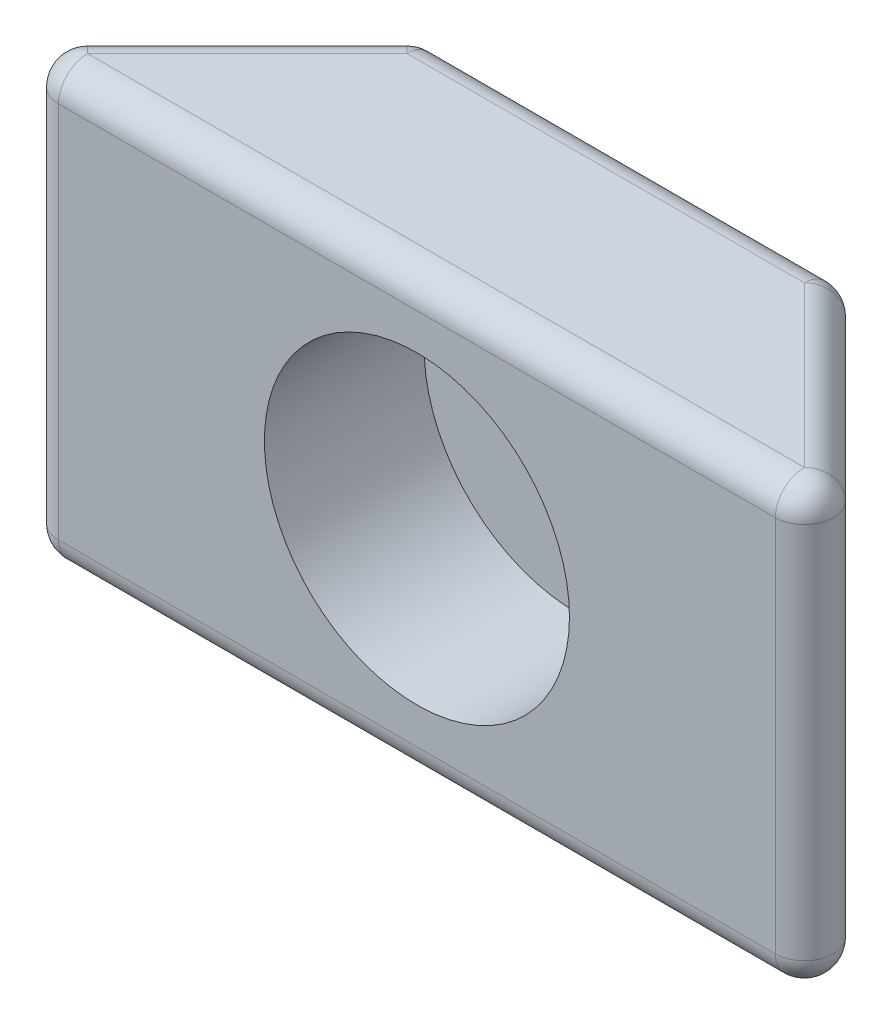
ISO-10303-21;
HEADER;
FILE_DESCRIPTION(('STEP AP214'),'2;1');
FILE_NAME('part.step','',(''),(''),'','','');
FILE_SCHEMA(('AUTOMOTIVE_DESIGN { 1 0 10303 214 1 1 1 1 }'));
ENDSEC;
DATA;
#1=APPLICATION_CONTEXT('core data for automotive mechanical design processes');
#2=APPLICATION_PROTOCOL_DEFINITION('international standard','automotive_design',2000,#1);
#3=PRODUCT_CONTEXT('',#1,'mechanical');
#4=PRODUCT('Part','Part','',(#3));
#5=PRODUCT_RELATED_PRODUCT_CATEGORY('part','',(#4));
#6=PRODUCT_DEFINITION_FORMATION('','',#4);
#7=PRODUCT_DEFINITION_CONTEXT('part definition',#1,'design');
#8=PRODUCT_DEFINITION('design','',#6,#7);
#9=PRODUCT_DEFINITION_SHAPE('','',#8);
#10=(LENGTH_UNIT() NAMED_UNIT(*) SI_UNIT(.MILLI.,.METRE.));
#11=(NAMED_UNIT(*) PLANE_ANGLE_UNIT() SI_UNIT($,.RADIAN.));
#12=(NAMED_UNIT(*) SI_UNIT($,.STERADIAN.) SOLID_ANGLE_UNIT());
#13=UNCERTAINTY_MEASURE_WITH_UNIT(LENGTH_MEASURE(1.E-05),#10,'distance_accuracy_value','');
#14=(GEOMETRIC_REPRESENTATION_CONTEXT(3) GLOBAL_UNCERTAINTY_ASSIGNED_CONTEXT((#13)) GLOBAL_UNIT_ASSIGNED_CONTEXT((#10,
#11,#12)) REPRESENTATION_CONTEXT('',''));
#15=CARTESIAN_POINT('',(0.,0.,0.));
#16=DIRECTION('',(0.,0.,1.));
#17=DIRECTION('',(1.,0.,0.));
#18=AXIS2_PLACEMENT_3D('',#15,#16,#17);
#19=CARTESIAN_POINT('',(-2.9,3.,-3.));
#20=DIRECTION('',(0.707106781186544,0.,0.707106781186551));
#21=DIRECTION('',(0.707106781186551,0.,-0.707106781186544));
#22=AXIS2_PLACEMENT_3D('',#19,#20,#21);
#23=PLANE('',#22);
#24=DIRECTION('',(-0.707106781186551,0.,0.707106781186544));
#25=VECTOR('',#24,1.);
#26=CARTESIAN_POINT('',(-2.9,2.6,-3.));
#27=LINE('',#26,#25);
#28=CARTESIAN_POINT('',(-5.2171572875254,2.6,-0.682842712474621));
#29=VERTEX_POINT('',#28);
#30=CARTESIAN_POINT('',(-3.01715728752538,2.6,-2.88284271247462));
#31=VERTEX_POINT('',#30);
#32=EDGE_CURVE('E47',#29,#31,#27,.F.);
#33=ORIENTED_EDGE('',*,*,#32,.T.);
#34=DIRECTION('',(0.,-1.,0.));
#35=VECTOR('',#34,1.);
#36=CARTESIAN_POINT('',(-3.01715728752538,3.,-2.88284271247462));
#37=LINE('',#36,#35);
#38=CARTESIAN_POINT('',(-3.01715728752538,-2.6,-2.88284271247462));
#39=VERTEX_POINT('',#38);
#40=EDGE_CURVE('E11',#31,#39,#37,.T.);
#41=ORIENTED_EDGE('',*,*,#40,.T.);
#42=DIRECTION('',(-0.707106781186551,0.,0.707106781186544));
#43=VECTOR('',#42,1.);
#44=CARTESIAN_POINT('',(-5.90000000000003,-2.6,0.));
#45=LINE('',#44,#43);
#46=CARTESIAN_POINT('',(-5.2171572875254,-2.6,-0.682842712474621));
#47=VERTEX_POINT('',#46);
#48=EDGE_CURVE('E200',#39,#47,#45,.T.);
#49=ORIENTED_EDGE('',*,*,#48,.T.);
#50=DIRECTION('',(0.,-1.,0.));
#51=VECTOR('',#50,1.);
#52=CARTESIAN_POINT('',(-5.2171572875254,3.,-0.682842712474622));
#53=LINE('',#52,#51);
#54=EDGE_CURVE('E58',#47,#29,#53,.F.);
#55=ORIENTED_EDGE('',*,*,#54,.T.);
#56=EDGE_LOOP('',(#33,#41,#49,#55));
#57=FACE_BOUND('',#56,.T.);
#58=ADVANCED_FACE('F38',(#57),#23,.F.);
#59=CARTESIAN_POINT('',(-5.90000000000003,3.,0.));
#60=DIRECTION('',(0.,0.,-1.));
#61=DIRECTION('',(-1.,0.,0.));
#62=AXIS2_PLACEMENT_3D('',#59,#60,#61);
#63=PLANE('',#62);
#64=DIRECTION('',(1.,0.,0.));
#65=VECTOR('',#64,1.);
#66=CARTESIAN_POINT('',(5.90000000000003,-2.6,0.));
#67=LINE('',#66,#65);
#68=CARTESIAN_POINT('',(-4.93431457505079,-2.6,0.));
#69=VERTEX_POINT('',#68);
#70=CARTESIAN_POINT('',(4.93431457505079,-2.6,0.));
#71=VERTEX_POINT('',#70);
#72=EDGE_CURVE('E175',#69,#71,#67,.T.);
#73=ORIENTED_EDGE('',*,*,#72,.T.);
#74=DIRECTION('',(0.,-1.,0.));
#75=VECTOR('',#74,1.);
#76=CARTESIAN_POINT('',(4.93431457505079,3.,0.));
#77=LINE('',#76,#75);
#78=CARTESIAN_POINT('',(4.93431457505079,2.6,0.));
#79=VERTEX_POINT('',#78);
#80=EDGE_CURVE('E180',#71,#79,#77,.F.);
#81=ORIENTED_EDGE('',*,*,#80,.T.);
#82=DIRECTION('',(1.,0.,0.));
#83=VECTOR('',#82,1.);
#84=CARTESIAN_POINT('',(-5.90000000000003,2.6,0.));
#85=LINE('',#84,#83);
#86=CARTESIAN_POINT('',(-4.93431457505079,2.6,0.));
#87=VERTEX_POINT('',#86);
#88=EDGE_CURVE('E177',#79,#87,#85,.F.);
#89=ORIENTED_EDGE('',*,*,#88,.T.);
#90=DIRECTION('',(0.,-1.,0.));
#91=VECTOR('',#90,1.);
#92=CARTESIAN_POINT('',(-4.93431457505079,3.,0.));
#93=LINE('',#92,#91);
#94=EDGE_CURVE('E173',#87,#69,#93,.T.);
#95=ORIENTED_EDGE('',*,*,#94,.T.);
#96=EDGE_LOOP('',(#73,#81,#89,#95));
#97=FACE_BOUND('',#96,.T.);
#98=CARTESIAN_POINT('',(0.,0.,0.));
#99=DIRECTION('',(0.,0.,1.));
#100=DIRECTION('',(1.,0.,0.));
#101=AXIS2_PLACEMENT_3D('',#98,#99,#100);
#102=CIRCLE('',#101,2.1);
#103=CARTESIAN_POINT('',(2.1,0.,0.));
#104=VERTEX_POINT('',#103);
#105=EDGE_CURVE('E261',#104,#104,#102,.T.);
#106=ORIENTED_EDGE('',*,*,#105,.F.);
#107=EDGE_LOOP('',(#106));
#108=FACE_BOUND('',#107,.T.);
#109=ADVANCED_FACE('F289',(#97,#108),#63,.F.);
#110=CARTESIAN_POINT('',(5.90000000000003,3.,0.));
#111=DIRECTION('',(-0.707106781186544,0.,0.707106781186551));
#112=DIRECTION('',(0.707106781186551,0.,0.707106781186544));
#113=AXIS2_PLACEMENT_3D('',#110,#111,#112);
#114=PLANE('',#113);
#115=DIRECTION('',(-0.707106781186551,0.,-0.707106781186544));
#116=VECTOR('',#115,1.);
#117=CARTESIAN_POINT('',(5.90000000000003,2.6,0.));
#118=LINE('',#117,#116);
#119=CARTESIAN_POINT('',(3.01715728752538,2.6,-2.88284271247462));
#120=VERTEX_POINT('',#119);
#121=CARTESIAN_POINT('',(5.2171572875254,2.6,-0.682842712474621));
#122=VERTEX_POINT('',#121);
#123=EDGE_CURVE('E195',#120,#122,#118,.F.);
#124=ORIENTED_EDGE('',*,*,#123,.T.);
#125=DIRECTION('',(0.,-1.,0.));
#126=VECTOR('',#125,1.);
#127=CARTESIAN_POINT('',(5.2171572875254,3.,-0.682842712474621));
#128=LINE('',#127,#126);
#129=CARTESIAN_POINT('',(5.2171572875254,-2.6,-0.682842712474621));
#130=VERTEX_POINT('',#129);
#131=EDGE_CURVE('E197',#122,#130,#128,.T.);
#132=ORIENTED_EDGE('',*,*,#131,.T.);
#133=DIRECTION('',(-0.707106781186551,0.,-0.707106781186544));
#134=VECTOR('',#133,1.);
#135=CARTESIAN_POINT('',(2.9,-2.6,-3.));
#136=LINE('',#135,#134);
#137=CARTESIAN_POINT('',(3.01715728752538,-2.6,-2.88284271247462));
#138=VERTEX_POINT('',#137);
#139=EDGE_CURVE('E191',#130,#138,#136,.T.);
#140=ORIENTED_EDGE('',*,*,#139,.T.);
#141=DIRECTION('',(0.,-1.,0.));
#142=VECTOR('',#141,1.);
#143=CARTESIAN_POINT('',(3.01715728752538,3.,-2.88284271247462));
#144=LINE('',#143,#142);
#145=EDGE_CURVE('E193',#138,#120,#144,.F.);
#146=ORIENTED_EDGE('',*,*,#145,.T.);
#147=EDGE_LOOP('',(#124,#132,#140,#146));
#148=FACE_BOUND('',#147,.T.);
#149=ADVANCED_FACE('F294',(#148),#114,.F.);
#150=CARTESIAN_POINT('',(2.9,3.,-3.));
#151=DIRECTION('',(0.,0.,1.));
#152=DIRECTION('',(1.,0.,0.));
#153=AXIS2_PLACEMENT_3D('',#150,#151,#152);
#154=PLANE('',#153);
#155=DIRECTION('',(-1.,0.,0.));
#156=VECTOR('',#155,1.);
#157=CARTESIAN_POINT('',(2.9,2.6,-3.));
#158=LINE('',#157,#156);
#159=CARTESIAN_POINT('',(-2.73431457505076,2.6,-3.));
#160=VERTEX_POINT('',#159);
#161=CARTESIAN_POINT('',(2.73431457505076,2.6,-3.));
#162=VERTEX_POINT('',#161);
#163=EDGE_CURVE('E134',#160,#162,#158,.F.);
#164=ORIENTED_EDGE('',*,*,#163,.T.);
#165=DIRECTION('',(0.,-1.,0.));
#166=VECTOR('',#165,1.);
#167=CARTESIAN_POINT('',(2.73431457505076,3.,-3.));
#168=LINE('',#167,#166);
#169=CARTESIAN_POINT('',(2.73431457505076,-2.6,-3.));
#170=VERTEX_POINT('',#169);
#171=EDGE_CURVE('E171',#162,#170,#168,.T.);
#172=ORIENTED_EDGE('',*,*,#171,.T.);
#173=DIRECTION('',(-1.,0.,0.));
#174=VECTOR('',#173,1.);
#175=CARTESIAN_POINT('',(-2.9,-2.6,-3.));
#176=LINE('',#175,#174);
#177=CARTESIAN_POINT('',(-2.73431457505076,-2.6,-3.));
#178=VERTEX_POINT('',#177);
#179=EDGE_CURVE('E168',#170,#178,#176,.T.);
#180=ORIENTED_EDGE('',*,*,#179,.T.);
#181=DIRECTION('',(0.,-1.,0.));
#182=VECTOR('',#181,1.);
#183=CARTESIAN_POINT('',(-2.73431457505076,3.,-3.));
#184=LINE('',#183,#182);
#185=EDGE_CURVE('E163',#178,#160,#184,.F.);
#186=ORIENTED_EDGE('',*,*,#185,.T.);
#187=EDGE_LOOP('',(#164,#172,#180,#186));
#188=FACE_BOUND('',#187,.T.);
#189=ADVANCED_FACE('F395',(#188),#154,.F.);
#190=CARTESIAN_POINT('',(0.,3.,0.));
#191=DIRECTION('',(0.,-1.,0.));
#192=DIRECTION('',(0.,0.,-1.));
#193=AXIS2_PLACEMENT_3D('',#190,#191,#192);
#194=PLANE('',#193);
#195=DIRECTION('',(1.,0.,0.));
#196=VECTOR('',#195,1.);
#197=CARTESIAN_POINT('',(0.,3.,-0.400000000000001));
#198=LINE('',#197,#196);
#199=CARTESIAN_POINT('',(-4.93431457505079,3.,-0.400000000000001));
#200=VERTEX_POINT('',#199);
#201=CARTESIAN_POINT('',(4.93431457505078,3.,-0.400000000000001));
#202=VERTEX_POINT('',#201);
#203=EDGE_CURVE('E155',#200,#202,#198,.T.);
#204=ORIENTED_EDGE('',*,*,#203,.T.);
#205=DIRECTION('',(-0.707106781186551,0.,-0.707106781186544));
#206=VECTOR('',#205,1.);
#207=CARTESIAN_POINT('',(2.66715728752537,3.,-2.66715728752539));
#208=LINE('',#207,#206);
#209=CARTESIAN_POINT('',(2.73431457505076,3.,-2.6));
#210=VERTEX_POINT('',#209);
#211=EDGE_CURVE('E160',#202,#210,#208,.T.);
#212=ORIENTED_EDGE('',*,*,#211,.T.);
#213=DIRECTION('',(-1.,0.,0.));
#214=VECTOR('',#213,1.);
#215=CARTESIAN_POINT('',(0.,3.,-2.6));
#216=LINE('',#215,#214);
#217=CARTESIAN_POINT('',(-2.73431457505076,3.,-2.6));
#218=VERTEX_POINT('',#217);
#219=EDGE_CURVE('E132',#210,#218,#216,.T.);
#220=ORIENTED_EDGE('',*,*,#219,.T.);
#221=DIRECTION('',(-0.707106781186551,0.,0.707106781186544));
#222=VECTOR('',#221,1.);
#223=CARTESIAN_POINT('',(-2.66715728752537,3.,-2.6671572875254));
#224=LINE('',#223,#222);
#225=EDGE_CURVE('E149',#218,#200,#224,.T.);
#226=ORIENTED_EDGE('',*,*,#225,.T.);
#227=EDGE_LOOP('',(#204,#212,#220,#226));
#228=FACE_BOUND('',#227,.T.);
#229=ADVANCED_FACE('F158',(#228),#194,.F.);
#230=CARTESIAN_POINT('',(0.,-3.,0.));
#231=DIRECTION('',(0.,-1.,0.));
#232=DIRECTION('',(0.,0.,-1.));
#233=AXIS2_PLACEMENT_3D('',#230,#231,#232);
#234=PLANE('',#233);
#235=DIRECTION('',(-1.,0.,0.));
#236=VECTOR('',#235,1.);
#237=CARTESIAN_POINT('',(2.9,-3.,-2.6));
#238=LINE('',#237,#236);
#239=CARTESIAN_POINT('',(-2.73431457505076,-3.,-2.6));
#240=VERTEX_POINT('',#239);
#241=CARTESIAN_POINT('',(2.73431457505076,-3.,-2.6));
#242=VERTEX_POINT('',#241);
#243=EDGE_CURVE('E184',#240,#242,#238,.F.);
#244=ORIENTED_EDGE('',*,*,#243,.T.);
#245=DIRECTION('',(-0.707106781186551,0.,-0.707106781186544));
#246=VECTOR('',#245,1.);
#247=CARTESIAN_POINT('',(5.61715728752541,-3.,0.282842712474619));
#248=LINE('',#247,#246);
#249=CARTESIAN_POINT('',(4.93431457505079,-3.,-0.400000000000001));
#250=VERTEX_POINT('',#249);
#251=EDGE_CURVE('E189',#242,#250,#248,.F.);
#252=ORIENTED_EDGE('',*,*,#251,.T.);
#253=DIRECTION('',(1.,0.,0.));
#254=VECTOR('',#253,1.);
#255=CARTESIAN_POINT('',(-5.90000000000003,-3.,-0.400000000000001));
#256=LINE('',#255,#254);
#257=CARTESIAN_POINT('',(-4.93431457505079,-3.,-0.400000000000001));
#258=VERTEX_POINT('',#257);
#259=EDGE_CURVE('E186',#250,#258,#256,.F.);
#260=ORIENTED_EDGE('',*,*,#259,.T.);
#261=DIRECTION('',(-0.707106781186551,0.,0.707106781186544));
#262=VECTOR('',#261,1.);
#263=CARTESIAN_POINT('',(-2.61715728752538,-3.,-2.71715728752538));
#264=LINE('',#263,#262);
#265=EDGE_CURVE('E182',#258,#240,#264,.F.);
#266=ORIENTED_EDGE('',*,*,#265,.T.);
#267=EDGE_LOOP('',(#244,#252,#260,#266));
#268=FACE_BOUND('',#267,.T.);
#269=ADVANCED_FACE('F278',(#268),#234,.T.);
#270=CARTESIAN_POINT('',(0.,0.,-2.2));
#271=DIRECTION('',(0.,0.,1.));
#272=DIRECTION('',(1.,0.,0.));
#273=AXIS2_PLACEMENT_3D('',#270,#271,#272);
#274=CYLINDRICAL_SURFACE('',#273,2.1);
#275=CARTESIAN_POINT('',(0.,0.,-2.2));
#276=DIRECTION('',(0.,0.,1.));
#277=DIRECTION('',(1.,0.,0.));
#278=AXIS2_PLACEMENT_3D('',#275,#276,#277);
#279=CIRCLE('',#278,2.1);
#280=CARTESIAN_POINT('',(2.1,0.,-2.2));
#281=VERTEX_POINT('',#280);
#282=EDGE_CURVE('E156',#281,#281,#279,.T.);
#283=ORIENTED_EDGE('',*,*,#282,.F.);
#284=EDGE_LOOP('',(#283));
#285=FACE_BOUND('',#284,.T.);
#286=ORIENTED_EDGE('',*,*,#105,.T.);
#287=EDGE_LOOP('',(#286));
#288=FACE_BOUND('',#287,.T.);
#289=ADVANCED_FACE('F276',(#285,#288),#274,.F.);
#290=CARTESIAN_POINT('',(0.,0.,-2.2));
#291=DIRECTION('',(0.,0.,1.));
#292=DIRECTION('',(1.,0.,0.));
#293=AXIS2_PLACEMENT_3D('',#290,#291,#292);
#294=PLANE('',#293);
#295=ORIENTED_EDGE('',*,*,#282,.T.);
#296=EDGE_LOOP('',(#295));
#297=FACE_BOUND('',#296,.T.);
#298=ADVANCED_FACE('F274',(#297),#294,.T.);
#299=CARTESIAN_POINT('',(-5.90000000000003,-2.6,-0.400000000000001));
#300=DIRECTION('',(-1.,0.,0.));
#301=DIRECTION('',(0.,0.,1.));
#302=AXIS2_PLACEMENT_3D('',#299,#300,#301);
#303=CYLINDRICAL_SURFACE('',#302,0.4);
#304=CARTESIAN_POINT('',(4.93431457505079,-2.6,-0.400000000000001));
#305=DIRECTION('',(1.,0.,0.));
#306=DIRECTION('',(0.,0.,-1.));
#307=AXIS2_PLACEMENT_3D('',#304,#305,#306);
#308=CIRCLE('',#307,0.4);
#309=EDGE_CURVE('E42',#71,#250,#308,.T.);
#310=ORIENTED_EDGE('',*,*,#309,.F.);
#311=ORIENTED_EDGE('',*,*,#72,.F.);
#312=CARTESIAN_POINT('',(-4.93431457505079,-2.6,-0.400000000000001));
#313=DIRECTION('',(-1.,0.,0.));
#314=DIRECTION('',(0.,0.,1.));
#315=AXIS2_PLACEMENT_3D('',#312,#313,#314);
#316=CIRCLE('',#315,0.4);
#317=EDGE_CURVE('E254',#258,#69,#316,.T.);
#318=ORIENTED_EDGE('',*,*,#317,.F.);
#319=ORIENTED_EDGE('',*,*,#259,.F.);
#320=EDGE_LOOP('',(#310,#311,#318,#319));
#321=FACE_BOUND('',#320,.T.);
#322=ADVANCED_FACE('F40',(#321),#303,.T.);
#323=CARTESIAN_POINT('',(4.93431457505079,-2.6,-0.400000000000001));
#324=DIRECTION('',(0.,-1.,0.));
#325=DIRECTION('',(0.,0.,-1.));
#326=AXIS2_PLACEMENT_3D('',#323,#324,#325);
#327=SPHERICAL_SURFACE('',#326,0.4);
#328=CARTESIAN_POINT('',(4.93431457505079,-2.6,-0.400000000000001));
#329=DIRECTION('',(0.,-1.,0.));
#330=DIRECTION('',(0.,0.,-1.));
#331=AXIS2_PLACEMENT_3D('',#328,#329,#330);
#332=CIRCLE('',#331,0.4);
#333=EDGE_CURVE('E249',#71,#130,#332,.F.);
#334=ORIENTED_EDGE('',*,*,#333,.F.);
#335=ORIENTED_EDGE('',*,*,#309,.T.);
#336=CARTESIAN_POINT('',(4.93431457505079,-2.6,-0.400000000000001));
#337=DIRECTION('',(0.707106781186551,0.,0.707106781186544));
#338=DIRECTION('',(0.707106781186544,0.,-0.707106781186551));
#339=AXIS2_PLACEMENT_3D('',#336,#337,#338);
#340=CIRCLE('',#339,0.4);
#341=EDGE_CURVE('E252',#130,#250,#340,.F.);
#342=ORIENTED_EDGE('',*,*,#341,.F.);
#343=EDGE_LOOP('',(#334,#335,#342));
#344=FACE_BOUND('',#343,.T.);
#345=ADVANCED_FACE('F363',(#344),#327,.T.);
#346=CARTESIAN_POINT('',(-4.93431457505079,-2.6,-0.400000000000001));
#347=DIRECTION('',(0.,-1.,0.));
#348=DIRECTION('',(0.,0.,-1.));
#349=AXIS2_PLACEMENT_3D('',#346,#347,#348);
#350=SPHERICAL_SURFACE('',#349,0.4);
#351=CARTESIAN_POINT('',(-4.93431457505079,-2.6,-0.400000000000001));
#352=DIRECTION('',(-0.707106781186551,0.,0.707106781186544));
#353=DIRECTION('',(0.707106781186544,0.,0.707106781186551));
#354=AXIS2_PLACEMENT_3D('',#351,#352,#353);
#355=CIRCLE('',#354,0.4);
#356=EDGE_CURVE('E243',#258,#47,#355,.F.);
#357=ORIENTED_EDGE('',*,*,#356,.F.);
#358=ORIENTED_EDGE('',*,*,#317,.T.);
#359=CARTESIAN_POINT('',(-4.93431457505079,-2.6,-0.400000000000001));
#360=DIRECTION('',(0.,-1.,0.));
#361=DIRECTION('',(0.,0.,-1.));
#362=AXIS2_PLACEMENT_3D('',#359,#360,#361);
#363=CIRCLE('',#362,0.4);
#364=EDGE_CURVE('E246',#47,#69,#363,.F.);
#365=ORIENTED_EDGE('',*,*,#364,.F.);
#366=EDGE_LOOP('',(#357,#358,#365));
#367=FACE_BOUND('',#366,.T.);
#368=ADVANCED_FACE('F360',(#367),#350,.T.);
#369=CARTESIAN_POINT('',(5.61715728752541,-2.6,0.282842712474619));
#370=DIRECTION('',(0.707106781186551,0.,0.707106781186544));
#371=DIRECTION('',(0.707106781186544,0.,-0.707106781186551));
#372=AXIS2_PLACEMENT_3D('',#369,#370,#371);
#373=CYLINDRICAL_SURFACE('',#372,0.4);
#374=ORIENTED_EDGE('',*,*,#341,.T.);
#375=ORIENTED_EDGE('',*,*,#251,.F.);
#376=CARTESIAN_POINT('',(2.73431457505076,-2.6,-2.6));
#377=DIRECTION('',(-0.707106781186551,0.,-0.707106781186544));
#378=DIRECTION('',(-0.707106781186544,0.,0.707106781186551));
#379=AXIS2_PLACEMENT_3D('',#376,#377,#378);
#380=CIRCLE('',#379,0.4);
#381=EDGE_CURVE('E237',#138,#242,#380,.T.);
#382=ORIENTED_EDGE('',*,*,#381,.F.);
#383=ORIENTED_EDGE('',*,*,#139,.F.);
#384=EDGE_LOOP('',(#374,#375,#382,#383));
#385=FACE_BOUND('',#384,.T.);
#386=ADVANCED_FACE('F356',(#385),#373,.T.);
#387=CARTESIAN_POINT('',(4.93431457505079,3.,-0.400000000000001));
#388=DIRECTION('',(0.,-1.,0.));
#389=DIRECTION('',(0.,0.,-1.));
#390=AXIS2_PLACEMENT_3D('',#387,#388,#389);
#391=CYLINDRICAL_SURFACE('',#390,0.4);
#392=ORIENTED_EDGE('',*,*,#333,.T.);
#393=ORIENTED_EDGE('',*,*,#131,.F.);
#394=CARTESIAN_POINT('',(4.93431457505079,2.6,-0.400000000000001));
#395=DIRECTION('',(0.,1.,0.));
#396=DIRECTION('',(0.,0.,1.));
#397=AXIS2_PLACEMENT_3D('',#394,#395,#396);
#398=CIRCLE('',#397,0.4);
#399=EDGE_CURVE('E234',#79,#122,#398,.T.);
#400=ORIENTED_EDGE('',*,*,#399,.F.);
#401=ORIENTED_EDGE('',*,*,#80,.F.);
#402=EDGE_LOOP('',(#392,#393,#400,#401));
#403=FACE_BOUND('',#402,.T.);
#404=ADVANCED_FACE('F352',(#403),#391,.T.);
#405=CARTESIAN_POINT('',(0.,2.6,-0.400000000000001));
#406=DIRECTION('',(1.,0.,0.));
#407=DIRECTION('',(0.,0.,-1.));
#408=AXIS2_PLACEMENT_3D('',#405,#406,#407);
#409=CYLINDRICAL_SURFACE('',#408,0.4);
#410=CARTESIAN_POINT('',(-4.93431457505079,2.6,-0.400000000000001));
#411=DIRECTION('',(-1.,0.,0.));
#412=DIRECTION('',(0.,0.,1.));
#413=AXIS2_PLACEMENT_3D('',#410,#411,#412);
#414=CIRCLE('',#413,0.4);
#415=EDGE_CURVE('E228',#87,#200,#414,.T.);
#416=ORIENTED_EDGE('',*,*,#415,.F.);
#417=ORIENTED_EDGE('',*,*,#88,.F.);
#418=CARTESIAN_POINT('',(4.93431457505078,2.6,-0.400000000000001));
#419=DIRECTION('',(1.,0.,0.));
#420=DIRECTION('',(0.,0.,-1.));
#421=AXIS2_PLACEMENT_3D('',#418,#419,#420);
#422=CIRCLE('',#421,0.4);
#423=EDGE_CURVE('E231',#202,#79,#422,.T.);
#424=ORIENTED_EDGE('',*,*,#423,.F.);
#425=ORIENTED_EDGE('',*,*,#203,.F.);
#426=EDGE_LOOP('',(#416,#417,#424,#425));
#427=FACE_BOUND('',#426,.T.);
#428=ADVANCED_FACE('F348',(#427),#409,.T.);
#429=CARTESIAN_POINT('',(-4.93431457505079,3.,-0.400000000000001));
#430=DIRECTION('',(0.,-1.,0.));
#431=DIRECTION('',(0.,0.,-1.));
#432=AXIS2_PLACEMENT_3D('',#429,#430,#431);
#433=CYLINDRICAL_SURFACE('',#432,0.4);
#434=ORIENTED_EDGE('',*,*,#364,.T.);
#435=ORIENTED_EDGE('',*,*,#94,.F.);
#436=CARTESIAN_POINT('',(-4.93431457505079,2.6,-0.400000000000001));
#437=DIRECTION('',(0.,1.,0.));
#438=DIRECTION('',(0.,0.,1.));
#439=AXIS2_PLACEMENT_3D('',#436,#437,#438);
#440=CIRCLE('',#439,0.4);
#441=EDGE_CURVE('E226',#29,#87,#440,.T.);
#442=ORIENTED_EDGE('',*,*,#441,.F.);
#443=ORIENTED_EDGE('',*,*,#54,.F.);
#444=EDGE_LOOP('',(#434,#435,#442,#443));
#445=FACE_BOUND('',#444,.T.);
#446=ADVANCED_FACE('F344',(#445),#433,.T.);
#447=CARTESIAN_POINT('',(-2.61715728752538,-2.6,-2.71715728752538));
#448=DIRECTION('',(0.707106781186551,0.,-0.707106781186544));
#449=DIRECTION('',(-0.707106781186544,0.,-0.707106781186551));
#450=AXIS2_PLACEMENT_3D('',#447,#448,#449);
#451=CYLINDRICAL_SURFACE('',#450,0.4);
#452=ORIENTED_EDGE('',*,*,#356,.T.);
#453=ORIENTED_EDGE('',*,*,#48,.F.);
#454=CARTESIAN_POINT('',(-2.73431457505076,-2.6,-2.6));
#455=DIRECTION('',(0.707106781186551,0.,-0.707106781186544));
#456=DIRECTION('',(-0.707106781186544,0.,-0.707106781186551));
#457=AXIS2_PLACEMENT_3D('',#454,#455,#456);
#458=CIRCLE('',#457,0.4);
#459=EDGE_CURVE('E223',#240,#39,#458,.T.);
#460=ORIENTED_EDGE('',*,*,#459,.F.);
#461=ORIENTED_EDGE('',*,*,#265,.F.);
#462=EDGE_LOOP('',(#452,#453,#460,#461));
#463=FACE_BOUND('',#462,.T.);
#464=ADVANCED_FACE('F340',(#463),#451,.T.);
#465=CARTESIAN_POINT('',(2.9,-2.6,-2.6));
#466=DIRECTION('',(1.,0.,0.));
#467=DIRECTION('',(0.,0.,-1.));
#468=AXIS2_PLACEMENT_3D('',#465,#466,#467);
#469=CYLINDRICAL_SURFACE('',#468,0.4);
#470=CARTESIAN_POINT('',(2.73431457505076,-2.6,-2.6));
#471=DIRECTION('',(1.,0.,0.));
#472=DIRECTION('',(0.,0.,-1.));
#473=AXIS2_PLACEMENT_3D('',#470,#471,#472);
#474=CIRCLE('',#473,0.4);
#475=EDGE_CURVE('E240',#242,#170,#474,.T.);
#476=ORIENTED_EDGE('',*,*,#475,.F.);
#477=ORIENTED_EDGE('',*,*,#243,.F.);
#478=CARTESIAN_POINT('',(-2.73431457505076,-2.6,-2.6));
#479=DIRECTION('',(-1.,0.,0.));
#480=DIRECTION('',(0.,0.,1.));
#481=AXIS2_PLACEMENT_3D('',#478,#479,#480);
#482=CIRCLE('',#481,0.4);
#483=EDGE_CURVE('E220',#178,#240,#482,.T.);
#484=ORIENTED_EDGE('',*,*,#483,.F.);
#485=ORIENTED_EDGE('',*,*,#179,.F.);
#486=EDGE_LOOP('',(#476,#477,#484,#485));
#487=FACE_BOUND('',#486,.T.);
#488=ADVANCED_FACE('F336',(#487),#469,.T.);
#489=CARTESIAN_POINT('',(2.73431457505076,-2.6,-2.6));
#490=DIRECTION('',(0.,-1.,0.));
#491=DIRECTION('',(0.,0.,-1.));
#492=AXIS2_PLACEMENT_3D('',#489,#490,#491);
#493=SPHERICAL_SURFACE('',#492,0.4);
#494=ORIENTED_EDGE('',*,*,#381,.T.);
#495=ORIENTED_EDGE('',*,*,#475,.T.);
#496=CARTESIAN_POINT('',(2.73431457505076,-2.6,-2.6));
#497=DIRECTION('',(0.,-1.,0.));
#498=DIRECTION('',(0.,0.,-1.));
#499=AXIS2_PLACEMENT_3D('',#496,#497,#498);
#500=CIRCLE('',#499,0.4);
#501=EDGE_CURVE('E217',#138,#170,#500,.F.);
#502=ORIENTED_EDGE('',*,*,#501,.F.);
#503=EDGE_LOOP('',(#494,#495,#502));
#504=FACE_BOUND('',#503,.T.);
#505=ADVANCED_FACE('F332',(#504),#493,.T.);
#506=CARTESIAN_POINT('',(4.93431457505079,2.6,-0.400000000000001));
#507=DIRECTION('',(0.,1.,0.));
#508=DIRECTION('',(-1.,0.,0.));
#509=AXIS2_PLACEMENT_3D('',#506,#507,#508);
#510=SPHERICAL_SURFACE('',#509,0.4);
#511=ORIENTED_EDGE('',*,*,#423,.T.);
#512=ORIENTED_EDGE('',*,*,#399,.T.);
#513=CARTESIAN_POINT('',(4.93431457505079,2.6,-0.400000000000001));
#514=DIRECTION('',(0.707106781186551,0.,0.707106781186544));
#515=DIRECTION('',(0.707106781186544,0.,-0.707106781186551));
#516=AXIS2_PLACEMENT_3D('',#513,#514,#515);
#517=CIRCLE('',#516,0.4);
#518=EDGE_CURVE('E214',#202,#122,#517,.F.);
#519=ORIENTED_EDGE('',*,*,#518,.F.);
#520=EDGE_LOOP('',(#511,#512,#519));
#521=FACE_BOUND('',#520,.T.);
#522=ADVANCED_FACE('F328',(#521),#510,.T.);
#523=CARTESIAN_POINT('',(-4.93431457505079,2.6,-0.400000000000001));
#524=DIRECTION('',(0.,1.,0.));
#525=DIRECTION('',(0.,0.,1.));
#526=AXIS2_PLACEMENT_3D('',#523,#524,#525);
#527=SPHERICAL_SURFACE('',#526,0.4);
#528=ORIENTED_EDGE('',*,*,#441,.T.);
#529=ORIENTED_EDGE('',*,*,#415,.T.);
#530=CARTESIAN_POINT('',(-4.93431457505079,2.6,-0.400000000000001));
#531=DIRECTION('',(-0.707106781186551,0.,0.707106781186544));
#532=DIRECTION('',(0.707106781186544,0.,0.707106781186551));
#533=AXIS2_PLACEMENT_3D('',#530,#531,#532);
#534=CIRCLE('',#533,0.4);
#535=EDGE_CURVE('E152',#29,#200,#534,.F.);
#536=ORIENTED_EDGE('',*,*,#535,.F.);
#537=EDGE_LOOP('',(#528,#529,#536));
#538=FACE_BOUND('',#537,.T.);
#539=ADVANCED_FACE('F324',(#538),#527,.T.);
#540=CARTESIAN_POINT('',(-2.73431457505076,-2.6,-2.6));
#541=DIRECTION('',(0.,-1.,0.));
#542=DIRECTION('',(0.,0.,-1.));
#543=AXIS2_PLACEMENT_3D('',#540,#541,#542);
#544=SPHERICAL_SURFACE('',#543,0.4);
#545=ORIENTED_EDGE('',*,*,#483,.T.);
#546=ORIENTED_EDGE('',*,*,#459,.T.);
#547=CARTESIAN_POINT('',(-2.73431457505076,-2.6,-2.6));
#548=DIRECTION('',(0.,-1.,0.));
#549=DIRECTION('',(0.,0.,-1.));
#550=AXIS2_PLACEMENT_3D('',#547,#548,#549);
#551=CIRCLE('',#550,0.4);
#552=EDGE_CURVE('E211',#178,#39,#551,.F.);
#553=ORIENTED_EDGE('',*,*,#552,.F.);
#554=EDGE_LOOP('',(#545,#546,#553));
#555=FACE_BOUND('',#554,.T.);
#556=ADVANCED_FACE('F320',(#555),#544,.T.);
#557=CARTESIAN_POINT('',(2.73431457505076,3.,-2.6));
#558=DIRECTION('',(0.,-1.,0.));
#559=DIRECTION('',(0.,0.,-1.));
#560=AXIS2_PLACEMENT_3D('',#557,#558,#559);
#561=CYLINDRICAL_SURFACE('',#560,0.4);
#562=ORIENTED_EDGE('',*,*,#501,.T.);
#563=ORIENTED_EDGE('',*,*,#171,.F.);
#564=CARTESIAN_POINT('',(2.73431457505076,2.6,-2.6));
#565=DIRECTION('',(0.,1.,0.));
#566=DIRECTION('',(0.,0.,1.));
#567=AXIS2_PLACEMENT_3D('',#564,#565,#566);
#568=CIRCLE('',#567,0.4);
#569=EDGE_CURVE('E208',#120,#162,#568,.T.);
#570=ORIENTED_EDGE('',*,*,#569,.F.);
#571=ORIENTED_EDGE('',*,*,#145,.F.);
#572=EDGE_LOOP('',(#562,#563,#570,#571));
#573=FACE_BOUND('',#572,.T.);
#574=ADVANCED_FACE('F316',(#573),#561,.T.);
#575=CARTESIAN_POINT('',(2.66715728752537,2.6,-2.6671572875254));
#576=DIRECTION('',(-0.707106781186551,0.,-0.707106781186544));
#577=DIRECTION('',(-0.707106781186544,0.,0.707106781186551));
#578=AXIS2_PLACEMENT_3D('',#575,#576,#577);
#579=CYLINDRICAL_SURFACE('',#578,0.4);
#580=ORIENTED_EDGE('',*,*,#518,.T.);
#581=ORIENTED_EDGE('',*,*,#123,.F.);
#582=CARTESIAN_POINT('',(2.73431457505076,2.6,-2.6));
#583=DIRECTION('',(-0.707106781186551,0.,-0.707106781186544));
#584=DIRECTION('',(-0.707106781186544,0.,0.707106781186551));
#585=AXIS2_PLACEMENT_3D('',#582,#583,#584);
#586=CIRCLE('',#585,0.4);
#587=EDGE_CURVE('E146',#210,#120,#586,.T.);
#588=ORIENTED_EDGE('',*,*,#587,.F.);
#589=ORIENTED_EDGE('',*,*,#211,.F.);
#590=EDGE_LOOP('',(#580,#581,#588,#589));
#591=FACE_BOUND('',#590,.T.);
#592=ADVANCED_FACE('F313',(#591),#579,.T.);
#593=CARTESIAN_POINT('',(-2.66715728752537,2.6,-2.6671572875254));
#594=DIRECTION('',(-0.707106781186551,0.,0.707106781186544));
#595=DIRECTION('',(0.707106781186544,0.,0.707106781186551));
#596=AXIS2_PLACEMENT_3D('',#593,#594,#595);
#597=CYLINDRICAL_SURFACE('',#596,0.4);
#598=ORIENTED_EDGE('',*,*,#535,.T.);
#599=ORIENTED_EDGE('',*,*,#225,.F.);
#600=CARTESIAN_POINT('',(-2.73431457505076,2.6,-2.6));
#601=DIRECTION('',(0.707106781186551,0.,-0.707106781186544));
#602=DIRECTION('',(-0.707106781186544,0.,-0.707106781186551));
#603=AXIS2_PLACEMENT_3D('',#600,#601,#602);
#604=CIRCLE('',#603,0.4);
#605=EDGE_CURVE('E140',#31,#218,#604,.T.);
#606=ORIENTED_EDGE('',*,*,#605,.F.);
#607=ORIENTED_EDGE('',*,*,#32,.F.);
#608=EDGE_LOOP('',(#598,#599,#606,#607));
#609=FACE_BOUND('',#608,.T.);
#610=ADVANCED_FACE('F150',(#609),#597,.T.);
#611=CARTESIAN_POINT('',(-2.73431457505076,3.,-2.6));
#612=DIRECTION('',(0.,-1.,0.));
#613=DIRECTION('',(0.,0.,-1.));
#614=AXIS2_PLACEMENT_3D('',#611,#612,#613);
#615=CYLINDRICAL_SURFACE('',#614,0.4);
#616=ORIENTED_EDGE('',*,*,#552,.T.);
#617=ORIENTED_EDGE('',*,*,#40,.F.);
#618=CARTESIAN_POINT('',(-2.73431457505076,2.6,-2.6));
#619=DIRECTION('',(0.,1.,0.));
#620=DIRECTION('',(0.,0.,1.));
#621=AXIS2_PLACEMENT_3D('',#618,#619,#620);
#622=CIRCLE('',#621,0.4);
#623=EDGE_CURVE('E144',#160,#31,#622,.T.);
#624=ORIENTED_EDGE('',*,*,#623,.F.);
#625=ORIENTED_EDGE('',*,*,#185,.F.);
#626=EDGE_LOOP('',(#616,#617,#624,#625));
#627=FACE_BOUND('',#626,.T.);
#628=ADVANCED_FACE('F306',(#627),#615,.T.);
#629=CARTESIAN_POINT('',(2.73431457505076,2.6,-2.6));
#630=DIRECTION('',(0.,1.,0.));
#631=DIRECTION('',(-1.,0.,0.));
#632=AXIS2_PLACEMENT_3D('',#629,#630,#631);
#633=SPHERICAL_SURFACE('',#632,0.4);
#634=ORIENTED_EDGE('',*,*,#587,.T.);
#635=ORIENTED_EDGE('',*,*,#569,.T.);
#636=CARTESIAN_POINT('',(2.73431457505076,2.6,-2.6));
#637=DIRECTION('',(1.,0.,0.));
#638=DIRECTION('',(0.,1.,0.));
#639=AXIS2_PLACEMENT_3D('',#636,#637,#638);
#640=CIRCLE('',#639,0.4);
#641=EDGE_CURVE('E137',#210,#162,#640,.F.);
#642=ORIENTED_EDGE('',*,*,#641,.F.);
#643=EDGE_LOOP('',(#634,#635,#642));
#644=FACE_BOUND('',#643,.T.);
#645=ADVANCED_FACE('F303',(#644),#633,.T.);
#646=CARTESIAN_POINT('',(-2.73431457505076,2.6,-2.6));
#647=DIRECTION('',(0.,1.,0.));
#648=DIRECTION('',(0.,0.,1.));
#649=AXIS2_PLACEMENT_3D('',#646,#647,#648);
#650=SPHERICAL_SURFACE('',#649,0.4);
#651=ORIENTED_EDGE('',*,*,#623,.T.);
#652=ORIENTED_EDGE('',*,*,#605,.T.);
#653=CARTESIAN_POINT('',(-2.73431457505076,2.6,-2.6));
#654=DIRECTION('',(-1.,0.,0.));
#655=DIRECTION('',(0.,0.,1.));
#656=AXIS2_PLACEMENT_3D('',#653,#654,#655);
#657=CIRCLE('',#656,0.4);
#658=EDGE_CURVE('E128',#160,#218,#657,.F.);
#659=ORIENTED_EDGE('',*,*,#658,.F.);
#660=EDGE_LOOP('',(#651,#652,#659));
#661=FACE_BOUND('',#660,.T.);
#662=ADVANCED_FACE('F142',(#661),#650,.T.);
#663=CARTESIAN_POINT('',(0.,2.6,-2.6));
#664=DIRECTION('',(-1.,0.,0.));
#665=DIRECTION('',(0.,0.,1.));
#666=AXIS2_PLACEMENT_3D('',#663,#664,#665);
#667=CYLINDRICAL_SURFACE('',#666,0.4);
#668=ORIENTED_EDGE('',*,*,#641,.T.);
#669=ORIENTED_EDGE('',*,*,#163,.F.);
#670=ORIENTED_EDGE('',*,*,#658,.T.);
#671=ORIENTED_EDGE('',*,*,#219,.F.);
#672=EDGE_LOOP('',(#668,#669,#670,#671));
#673=FACE_BOUND('',#672,.T.);
#674=ADVANCED_FACE('F130',(#673),#667,.T.);
#675=CLOSED_SHELL('',(#58,#109,#149,#189,#229,#269,#289,#298,#322,#345,#368,#386,#404,#428,#446,
#464,#488,#505,#522,#539,#556,#574,#592,#610,#628,#645,#662,#674));
#676=MANIFOLD_SOLID_BREP('B2',#675);
#677=ADVANCED_BREP_SHAPE_REPRESENTATION('',(#18,#676),#14);
#678=SHAPE_DEFINITION_REPRESENTATION(#9,#677);
ENDSEC;
END-ISO-10303-21;
